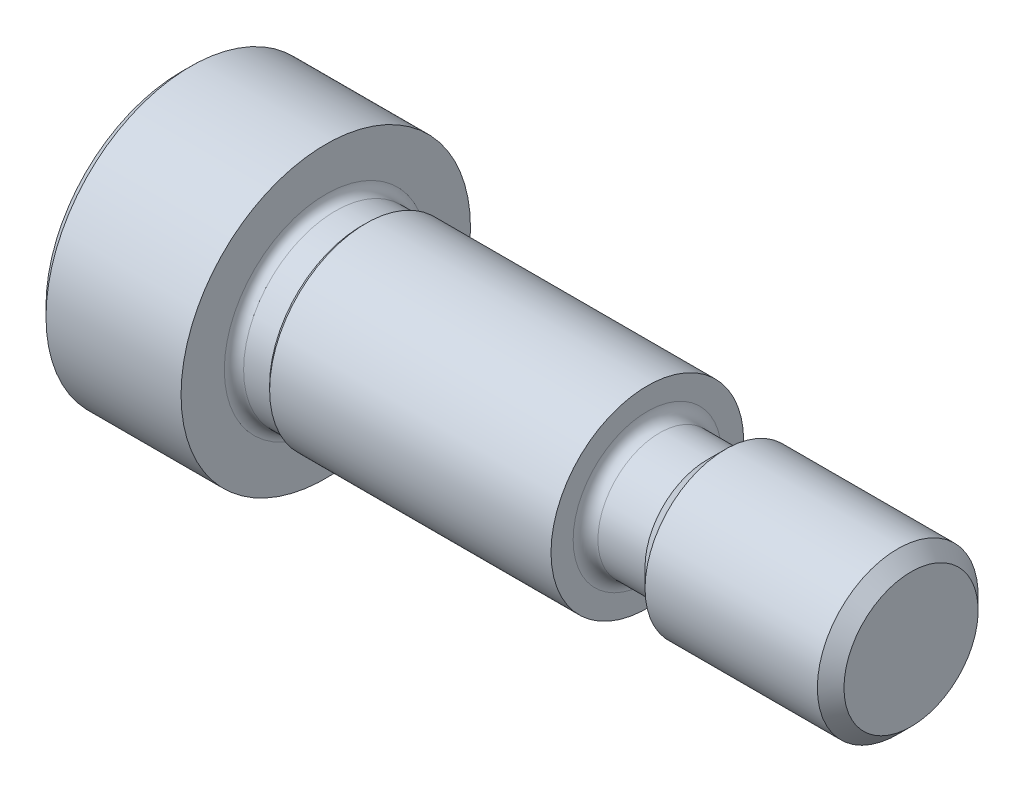
ISO-10303-21;
HEADER;
FILE_DESCRIPTION(('STEP AP214'),'2;1');
FILE_NAME('part.step','',(''),(''),'','','');
FILE_SCHEMA(('AUTOMOTIVE_DESIGN { 1 0 10303 214 1 1 1 1 }'));
ENDSEC;
DATA;
#1=APPLICATION_CONTEXT('core data for automotive mechanical design processes');
#2=APPLICATION_PROTOCOL_DEFINITION('international standard','automotive_design',2000,#1);
#3=PRODUCT_CONTEXT('',#1,'mechanical');
#4=PRODUCT('Part','Part','',(#3));
#5=PRODUCT_RELATED_PRODUCT_CATEGORY('part','',(#4));
#6=PRODUCT_DEFINITION_FORMATION('','',#4);
#7=PRODUCT_DEFINITION_CONTEXT('part definition',#1,'design');
#8=PRODUCT_DEFINITION('design','',#6,#7);
#9=PRODUCT_DEFINITION_SHAPE('','',#8);
#10=(LENGTH_UNIT() NAMED_UNIT(*) SI_UNIT(.MILLI.,.METRE.));
#11=(NAMED_UNIT(*) PLANE_ANGLE_UNIT() SI_UNIT($,.RADIAN.));
#12=(NAMED_UNIT(*) SI_UNIT($,.STERADIAN.) SOLID_ANGLE_UNIT());
#13=UNCERTAINTY_MEASURE_WITH_UNIT(LENGTH_MEASURE(1.E-05),#10,'distance_accuracy_value','');
#14=(GEOMETRIC_REPRESENTATION_CONTEXT(3) GLOBAL_UNCERTAINTY_ASSIGNED_CONTEXT((#13)) GLOBAL_UNIT_ASSIGNED_CONTEXT((#10,
#11,#12)) REPRESENTATION_CONTEXT('',''));
#15=CARTESIAN_POINT('',(0.,0.,0.));
#16=DIRECTION('',(0.,0.,1.));
#17=DIRECTION('',(1.,0.,0.));
#18=AXIS2_PLACEMENT_3D('',#15,#16,#17);
#19=CARTESIAN_POINT('',(0.,0.,0.));
#20=DIRECTION('',(-1.,0.,0.));
#21=DIRECTION('',(0.,0.,1.));
#22=AXIS2_PLACEMENT_3D('',#19,#20,#21);
#23=PLANE('',#22);
#24=CARTESIAN_POINT('',(0.,0.,0.));
#25=DIRECTION('',(-1.,0.,0.));
#26=DIRECTION('',(0.,0.,1.));
#27=AXIS2_PLACEMENT_3D('',#24,#25,#26);
#28=CIRCLE('',#27,8.4);
#29=CARTESIAN_POINT('',(0.,0.,8.4));
#30=VERTEX_POINT('',#29);
#31=EDGE_CURVE('E42',#30,#30,#28,.T.);
#32=ORIENTED_EDGE('',*,*,#31,.T.);
#33=EDGE_LOOP('',(#32));
#34=FACE_BOUND('',#33,.T.);
#35=DIRECTION('',(0.,-0.500000000000001,-0.866025403784438));
#36=VECTOR('',#35,1.);
#37=CARTESIAN_POINT('',(0.,-1.75947494535538,3.0475));
#38=LINE('',#37,#36);
#39=CARTESIAN_POINT('',(0.,-1.75947494535538,3.0475));
#40=VERTEX_POINT('',#39);
#41=CARTESIAN_POINT('',(0.,-3.51894989071077,0.));
#42=VERTEX_POINT('',#41);
#43=EDGE_CURVE('E49',#40,#42,#38,.T.);
#44=ORIENTED_EDGE('',*,*,#43,.T.);
#45=DIRECTION('',(0.,0.500000000000001,-0.866025403784438));
#46=VECTOR('',#45,1.);
#47=CARTESIAN_POINT('',(0.,-3.51894989071077,0.));
#48=LINE('',#47,#46);
#49=CARTESIAN_POINT('',(0.,-1.75947494535538,-3.0475));
#50=VERTEX_POINT('',#49);
#51=EDGE_CURVE('E304',#42,#50,#48,.T.);
#52=ORIENTED_EDGE('',*,*,#51,.T.);
#53=DIRECTION('',(0.,1.,0.));
#54=VECTOR('',#53,1.);
#55=CARTESIAN_POINT('',(0.,-1.75947494535538,-3.0475));
#56=LINE('',#55,#54);
#57=CARTESIAN_POINT('',(0.,1.75947494535538,-3.0475));
#58=VERTEX_POINT('',#57);
#59=EDGE_CURVE('E134',#50,#58,#56,.T.);
#60=ORIENTED_EDGE('',*,*,#59,.T.);
#61=DIRECTION('',(0.,0.500000000000001,0.866025403784438));
#62=VECTOR('',#61,1.);
#63=CARTESIAN_POINT('',(0.,1.75947494535538,-3.0475));
#64=LINE('',#63,#62);
#65=CARTESIAN_POINT('',(0.,3.51894989071077,0.));
#66=VERTEX_POINT('',#65);
#67=EDGE_CURVE('E307',#58,#66,#64,.T.);
#68=ORIENTED_EDGE('',*,*,#67,.T.);
#69=DIRECTION('',(0.,-0.500000000000001,0.866025403784438));
#70=VECTOR('',#69,1.);
#71=CARTESIAN_POINT('',(0.,3.51894989071077,0.));
#72=LINE('',#71,#70);
#73=CARTESIAN_POINT('',(0.,1.75947494535538,3.0475));
#74=VERTEX_POINT('',#73);
#75=EDGE_CURVE('E309',#66,#74,#72,.T.);
#76=ORIENTED_EDGE('',*,*,#75,.T.);
#77=DIRECTION('',(0.,-1.,0.));
#78=VECTOR('',#77,1.);
#79=CARTESIAN_POINT('',(0.,1.75947494535538,3.0475));
#80=LINE('',#79,#78);
#81=EDGE_CURVE('E311',#74,#40,#80,.T.);
#82=ORIENTED_EDGE('',*,*,#81,.T.);
#83=EDGE_LOOP('',(#44,#52,#60,#68,#76,#82));
#84=FACE_BOUND('',#83,.T.);
#85=ADVANCED_FACE('F34',(#34,#84),#23,.T.);
#86=CARTESIAN_POINT('',(-6.34999999999999,0.,0.));
#87=DIRECTION('',(-1.,0.,0.));
#88=DIRECTION('',(0.,0.,1.));
#89=AXIS2_PLACEMENT_3D('',#86,#87,#88);
#90=CYLINDRICAL_SURFACE('',#89,9.);
#91=CARTESIAN_POINT('',(0.600000000000002,0.,0.));
#92=DIRECTION('',(-1.,0.,0.));
#93=DIRECTION('',(0.,0.,1.));
#94=AXIS2_PLACEMENT_3D('',#91,#92,#93);
#95=CIRCLE('',#94,9.);
#96=CARTESIAN_POINT('',(0.600000000000002,0.,9.));
#97=VERTEX_POINT('',#96);
#98=EDGE_CURVE('E11',#97,#97,#95,.F.);
#99=ORIENTED_EDGE('',*,*,#98,.T.);
#100=EDGE_LOOP('',(#99));
#101=FACE_BOUND('',#100,.T.);
#102=CARTESIAN_POINT('',(9.,0.,0.));
#103=DIRECTION('',(-1.,0.,0.));
#104=DIRECTION('',(0.,0.,1.));
#105=AXIS2_PLACEMENT_3D('',#102,#103,#104);
#106=CIRCLE('',#105,9.);
#107=CARTESIAN_POINT('',(9.,0.,9.));
#108=VERTEX_POINT('',#107);
#109=EDGE_CURVE('E181',#108,#108,#106,.T.);
#110=ORIENTED_EDGE('',*,*,#109,.T.);
#111=EDGE_LOOP('',(#110));
#112=FACE_BOUND('',#111,.T.);
#113=ADVANCED_FACE('F200',(#101,#112),#90,.T.);
#114=CARTESIAN_POINT('',(9.,9.,0.));
#115=DIRECTION('',(1.,0.,0.));
#116=DIRECTION('',(0.,0.,-1.));
#117=AXIS2_PLACEMENT_3D('',#114,#115,#116);
#118=PLANE('',#117);
#119=CARTESIAN_POINT('',(9.,0.,0.));
#120=DIRECTION('',(-1.,0.,0.));
#121=DIRECTION('',(0.,0.,1.));
#122=AXIS2_PLACEMENT_3D('',#119,#120,#121);
#123=CIRCLE('',#122,6.31);
#124=CARTESIAN_POINT('',(9.,0.,6.31));
#125=VERTEX_POINT('',#124);
#126=EDGE_CURVE('E178',#125,#125,#123,.T.);
#127=ORIENTED_EDGE('',*,*,#126,.T.);
#128=EDGE_LOOP('',(#127));
#129=FACE_BOUND('',#128,.T.);
#130=ORIENTED_EDGE('',*,*,#109,.F.);
#131=EDGE_LOOP('',(#130));
#132=FACE_BOUND('',#131,.T.);
#133=ADVANCED_FACE('F204',(#129,#132),#118,.T.);
#134=CARTESIAN_POINT('',(9.6,0.,0.));
#135=DIRECTION('',(-1.,0.,0.));
#136=DIRECTION('',(0.,0.,1.));
#137=AXIS2_PLACEMENT_3D('',#134,#135,#136);
#138=TOROIDAL_SURFACE('',#137,6.31,0.599999999999999);
#139=ORIENTED_EDGE('',*,*,#126,.F.);
#140=EDGE_LOOP('',(#139));
#141=FACE_BOUND('',#140,.T.);
#142=CARTESIAN_POINT('',(9.6,0.,0.));
#143=DIRECTION('',(-1.,0.,0.));
#144=DIRECTION('',(0.,0.,1.));
#145=AXIS2_PLACEMENT_3D('',#142,#143,#144);
#146=CIRCLE('',#145,5.71);
#147=CARTESIAN_POINT('',(9.6,0.,5.71));
#148=VERTEX_POINT('',#147);
#149=EDGE_CURVE('E175',#148,#148,#146,.T.);
#150=ORIENTED_EDGE('',*,*,#149,.T.);
#151=EDGE_LOOP('',(#150));
#152=FACE_BOUND('',#151,.T.);
#153=ADVANCED_FACE('F210',(#141,#152),#138,.F.);
#154=CARTESIAN_POINT('',(-6.34999999999999,0.,0.));
#155=DIRECTION('',(-1.,0.,0.));
#156=DIRECTION('',(0.,0.,1.));
#157=AXIS2_PLACEMENT_3D('',#154,#155,#156);
#158=CYLINDRICAL_SURFACE('',#157,5.71);
#159=CARTESIAN_POINT('',(11.218,0.,0.));
#160=DIRECTION('',(-1.,0.,0.));
#161=DIRECTION('',(0.,0.,1.));
#162=AXIS2_PLACEMENT_3D('',#159,#160,#161);
#163=CIRCLE('',#162,5.71);
#164=CARTESIAN_POINT('',(11.218,0.,5.71));
#165=VERTEX_POINT('',#164);
#166=EDGE_CURVE('E172',#165,#165,#163,.T.);
#167=ORIENTED_EDGE('',*,*,#166,.T.);
#168=EDGE_LOOP('',(#167));
#169=FACE_BOUND('',#168,.T.);
#170=ORIENTED_EDGE('',*,*,#149,.F.);
#171=EDGE_LOOP('',(#170));
#172=FACE_BOUND('',#171,.T.);
#173=ADVANCED_FACE('F214',(#169,#172),#158,.T.);
#174=CARTESIAN_POINT('',(11.218,0.,0.));
#175=DIRECTION('',(1.,0.,0.));
#176=DIRECTION('',(0.,0.,-1.));
#177=AXIS2_PLACEMENT_3D('',#174,#175,#176);
#178=CONICAL_SURFACE('',#177,5.71,0.785398163397448);
#179=CARTESIAN_POINT('',(11.5,0.,0.));
#180=DIRECTION('',(-1.,0.,0.));
#181=DIRECTION('',(0.,0.,1.));
#182=AXIS2_PLACEMENT_3D('',#179,#180,#181);
#183=CIRCLE('',#182,5.992);
#184=CARTESIAN_POINT('',(11.5,0.,5.992));
#185=VERTEX_POINT('',#184);
#186=EDGE_CURVE('E169',#185,#185,#183,.T.);
#187=ORIENTED_EDGE('',*,*,#186,.T.);
#188=EDGE_LOOP('',(#187));
#189=FACE_BOUND('',#188,.T.);
#190=ORIENTED_EDGE('',*,*,#166,.F.);
#191=EDGE_LOOP('',(#190));
#192=FACE_BOUND('',#191,.T.);
#193=ADVANCED_FACE('F218',(#189,#192),#178,.T.);
#194=CARTESIAN_POINT('',(-6.34999999999999,0.,0.));
#195=DIRECTION('',(-1.,0.,0.));
#196=DIRECTION('',(0.,0.,1.));
#197=AXIS2_PLACEMENT_3D('',#194,#195,#196);
#198=CYLINDRICAL_SURFACE('',#197,5.992);
#199=CARTESIAN_POINT('',(29.,0.,0.));
#200=DIRECTION('',(-1.,0.,0.));
#201=DIRECTION('',(0.,0.,1.));
#202=AXIS2_PLACEMENT_3D('',#199,#200,#201);
#203=CIRCLE('',#202,5.992);
#204=CARTESIAN_POINT('',(29.,0.,5.992));
#205=VERTEX_POINT('',#204);
#206=EDGE_CURVE('E166',#205,#205,#203,.T.);
#207=ORIENTED_EDGE('',*,*,#206,.T.);
#208=EDGE_LOOP('',(#207));
#209=FACE_BOUND('',#208,.T.);
#210=ORIENTED_EDGE('',*,*,#186,.F.);
#211=EDGE_LOOP('',(#210));
#212=FACE_BOUND('',#211,.T.);
#213=ADVANCED_FACE('F222',(#209,#212),#198,.T.);
#214=CARTESIAN_POINT('',(29.,5.992,0.));
#215=DIRECTION('',(1.,0.,0.));
#216=DIRECTION('',(0.,0.,-1.));
#217=AXIS2_PLACEMENT_3D('',#214,#215,#216);
#218=PLANE('',#217);
#219=CARTESIAN_POINT('',(29.,0.,0.));
#220=DIRECTION('',(-1.,0.,0.));
#221=DIRECTION('',(0.,0.,1.));
#222=AXIS2_PLACEMENT_3D('',#219,#220,#221);
#223=CIRCLE('',#222,4.615);
#224=CARTESIAN_POINT('',(29.,0.,4.615));
#225=VERTEX_POINT('',#224);
#226=EDGE_CURVE('E163',#225,#225,#223,.T.);
#227=ORIENTED_EDGE('',*,*,#226,.T.);
#228=EDGE_LOOP('',(#227));
#229=FACE_BOUND('',#228,.T.);
#230=ORIENTED_EDGE('',*,*,#206,.F.);
#231=EDGE_LOOP('',(#230));
#232=FACE_BOUND('',#231,.T.);
#233=ADVANCED_FACE('F226',(#229,#232),#218,.T.);
#234=CARTESIAN_POINT('',(29.77,0.,0.));
#235=DIRECTION('',(-1.,0.,0.));
#236=DIRECTION('',(0.,0.,1.));
#237=AXIS2_PLACEMENT_3D('',#234,#235,#236);
#238=TOROIDAL_SURFACE('',#237,4.615,0.769999999999998);
#239=CARTESIAN_POINT('',(29.77,0.,0.));
#240=DIRECTION('',(-1.,0.,0.));
#241=DIRECTION('',(0.,0.,1.));
#242=AXIS2_PLACEMENT_3D('',#239,#240,#241);
#243=CIRCLE('',#242,3.845);
#244=CARTESIAN_POINT('',(29.77,0.,3.845));
#245=VERTEX_POINT('',#244);
#246=EDGE_CURVE('E160',#245,#245,#243,.T.);
#247=ORIENTED_EDGE('',*,*,#246,.T.);
#248=EDGE_LOOP('',(#247));
#249=FACE_BOUND('',#248,.T.);
#250=ORIENTED_EDGE('',*,*,#226,.F.);
#251=EDGE_LOOP('',(#250));
#252=FACE_BOUND('',#251,.T.);
#253=ADVANCED_FACE('F230',(#249,#252),#238,.F.);
#254=CARTESIAN_POINT('',(-6.34999999999999,0.,0.));
#255=DIRECTION('',(-1.,0.,0.));
#256=DIRECTION('',(0.,0.,1.));
#257=AXIS2_PLACEMENT_3D('',#254,#255,#256);
#258=CYLINDRICAL_SURFACE('',#257,3.845);
#259=CARTESIAN_POINT('',(32.7,0.,0.));
#260=DIRECTION('',(-1.,0.,0.));
#261=DIRECTION('',(0.,0.,1.));
#262=AXIS2_PLACEMENT_3D('',#259,#260,#261);
#263=CIRCLE('',#262,3.845);
#264=CARTESIAN_POINT('',(32.7,0.,3.845));
#265=VERTEX_POINT('',#264);
#266=EDGE_CURVE('E157',#265,#265,#263,.T.);
#267=ORIENTED_EDGE('',*,*,#266,.T.);
#268=EDGE_LOOP('',(#267));
#269=FACE_BOUND('',#268,.T.);
#270=ORIENTED_EDGE('',*,*,#246,.F.);
#271=EDGE_LOOP('',(#270));
#272=FACE_BOUND('',#271,.T.);
#273=ADVANCED_FACE('F234',(#269,#272),#258,.T.);
#274=CARTESIAN_POINT('',(32.7,0.,0.));
#275=DIRECTION('',(1.,0.,0.));
#276=DIRECTION('',(0.,0.,-1.));
#277=AXIS2_PLACEMENT_3D('',#274,#275,#276);
#278=CONICAL_SURFACE('',#277,3.845,0.785398163397447);
#279=CARTESIAN_POINT('',(33.855,0.,0.));
#280=DIRECTION('',(-1.,0.,0.));
#281=DIRECTION('',(0.,0.,1.));
#282=AXIS2_PLACEMENT_3D('',#279,#280,#281);
#283=CIRCLE('',#282,5.);
#284=CARTESIAN_POINT('',(33.855,0.,5.));
#285=VERTEX_POINT('',#284);
#286=EDGE_CURVE('E154',#285,#285,#283,.T.);
#287=ORIENTED_EDGE('',*,*,#286,.T.);
#288=EDGE_LOOP('',(#287));
#289=FACE_BOUND('',#288,.T.);
#290=ORIENTED_EDGE('',*,*,#266,.F.);
#291=EDGE_LOOP('',(#290));
#292=FACE_BOUND('',#291,.T.);
#293=ADVANCED_FACE('F238',(#289,#292),#278,.T.);
#294=CARTESIAN_POINT('',(-6.34999999999999,0.,0.));
#295=DIRECTION('',(-1.,0.,0.));
#296=DIRECTION('',(0.,0.,1.));
#297=AXIS2_PLACEMENT_3D('',#294,#295,#296);
#298=CYLINDRICAL_SURFACE('',#297,5.);
#299=CARTESIAN_POINT('',(44.572,0.,0.));
#300=DIRECTION('',(-1.,0.,0.));
#301=DIRECTION('',(0.,0.,1.));
#302=AXIS2_PLACEMENT_3D('',#299,#300,#301);
#303=CIRCLE('',#302,5.);
#304=CARTESIAN_POINT('',(44.572,0.,5.));
#305=VERTEX_POINT('',#304);
#306=EDGE_CURVE('E151',#305,#305,#303,.T.);
#307=ORIENTED_EDGE('',*,*,#306,.T.);
#308=EDGE_LOOP('',(#307));
#309=FACE_BOUND('',#308,.T.);
#310=ORIENTED_EDGE('',*,*,#286,.F.);
#311=EDGE_LOOP('',(#310));
#312=FACE_BOUND('',#311,.T.);
#313=ADVANCED_FACE('F242',(#309,#312),#298,.T.);
#314=CARTESIAN_POINT('',(44.572,0.,0.));
#315=DIRECTION('',(-1.,0.,0.));
#316=DIRECTION('',(0.,0.,1.));
#317=AXIS2_PLACEMENT_3D('',#314,#315,#316);
#318=CONICAL_SURFACE('',#317,5.,0.785398163397432);
#319=CARTESIAN_POINT('',(45.4,0.,0.));
#320=DIRECTION('',(-1.,0.,0.));
#321=DIRECTION('',(0.,0.,1.));
#322=AXIS2_PLACEMENT_3D('',#319,#320,#321);
#323=CIRCLE('',#322,4.17200000000001);
#324=CARTESIAN_POINT('',(45.4,0.,4.17200000000001));
#325=VERTEX_POINT('',#324);
#326=EDGE_CURVE('E147',#325,#325,#323,.T.);
#327=ORIENTED_EDGE('',*,*,#326,.T.);
#328=EDGE_LOOP('',(#327));
#329=FACE_BOUND('',#328,.T.);
#330=ORIENTED_EDGE('',*,*,#306,.F.);
#331=EDGE_LOOP('',(#330));
#332=FACE_BOUND('',#331,.T.);
#333=ADVANCED_FACE('F195',(#329,#332),#318,.T.);
#334=CARTESIAN_POINT('',(45.4,4.17200000000001,0.));
#335=DIRECTION('',(1.,0.,0.));
#336=DIRECTION('',(0.,0.,-1.));
#337=AXIS2_PLACEMENT_3D('',#334,#335,#336);
#338=PLANE('',#337);
#339=ORIENTED_EDGE('',*,*,#326,.F.);
#340=EDGE_LOOP('',(#339));
#341=FACE_BOUND('',#340,.T.);
#342=ADVANCED_FACE('F188',(#341),#338,.T.);
#343=CARTESIAN_POINT('',(0.,0.,0.));
#344=DIRECTION('',(1.,0.,0.));
#345=DIRECTION('',(0.,0.,-1.));
#346=AXIS2_PLACEMENT_3D('',#343,#344,#345);
#347=CONICAL_SURFACE('',#346,8.4,0.785398163397447);
#348=ORIENTED_EDGE('',*,*,#98,.F.);
#349=EDGE_LOOP('',(#348));
#350=FACE_BOUND('',#349,.T.);
#351=ORIENTED_EDGE('',*,*,#31,.F.);
#352=EDGE_LOOP('',(#351));
#353=FACE_BOUND('',#352,.T.);
#354=ADVANCED_FACE('F36',(#350,#353),#347,.T.);
#355=CARTESIAN_POINT('',(4.9,-3.51894989071077,0.));
#356=DIRECTION('',(0.,0.866025403784438,0.500000000000001));
#357=DIRECTION('',(0.,-0.500000000000001,0.866025403784438));
#358=AXIS2_PLACEMENT_3D('',#355,#356,#357);
#359=PLANE('',#358);
#360=DIRECTION('',(0.,0.500000000000001,-0.866025403784438));
#361=VECTOR('',#360,1.);
#362=CARTESIAN_POINT('',(4.9,-3.51894989071077,0.));
#363=LINE('',#362,#361);
#364=CARTESIAN_POINT('',(4.9,-3.51894989071077,0.));
#365=VERTEX_POINT('',#364);
#366=CARTESIAN_POINT('',(4.9,-2.63921241803307,-1.52375));
#367=VERTEX_POINT('',#366);
#368=EDGE_CURVE('E117',#365,#367,#363,.T.);
#369=ORIENTED_EDGE('',*,*,#368,.T.);
#370=CARTESIAN_POINT('',(4.9,-1.75947494535538,-3.0475));
#371=VERTEX_POINT('',#370);
#372=EDGE_CURVE('E110',#367,#371,#363,.T.);
#373=ORIENTED_EDGE('',*,*,#372,.T.);
#374=DIRECTION('',(-1.,0.,0.));
#375=VECTOR('',#374,1.);
#376=CARTESIAN_POINT('',(4.9,-1.75947494535538,-3.0475));
#377=LINE('',#376,#375);
#378=EDGE_CURVE('E114',#371,#50,#377,.T.);
#379=ORIENTED_EDGE('',*,*,#378,.T.);
#380=ORIENTED_EDGE('',*,*,#51,.F.);
#381=DIRECTION('',(-1.,0.,0.));
#382=VECTOR('',#381,1.);
#383=CARTESIAN_POINT('',(4.9,-3.51894989071077,0.));
#384=LINE('',#383,#382);
#385=EDGE_CURVE('E303',#365,#42,#384,.T.);
#386=ORIENTED_EDGE('',*,*,#385,.F.);
#387=EDGE_LOOP('',(#369,#373,#379,#380,#386));
#388=FACE_BOUND('',#387,.T.);
#389=ADVANCED_FACE('F112',(#388),#359,.T.);
#390=CARTESIAN_POINT('',(4.9,-1.75947494535538,-3.0475));
#391=DIRECTION('',(0.,0.,1.));
#392=DIRECTION('',(1.,0.,0.));
#393=AXIS2_PLACEMENT_3D('',#390,#391,#392);
#394=PLANE('',#393);
#395=DIRECTION('',(0.,1.,0.));
#396=VECTOR('',#395,1.);
#397=CARTESIAN_POINT('',(4.9,-1.75947494535538,-3.0475));
#398=LINE('',#397,#396);
#399=CARTESIAN_POINT('',(4.9,0.,-3.0475));
#400=VERTEX_POINT('',#399);
#401=EDGE_CURVE('E122',#371,#400,#398,.T.);
#402=ORIENTED_EDGE('',*,*,#401,.T.);
#403=CARTESIAN_POINT('',(4.9,1.75947494535538,-3.0475));
#404=VERTEX_POINT('',#403);
#405=EDGE_CURVE('E129',#400,#404,#398,.T.);
#406=ORIENTED_EDGE('',*,*,#405,.T.);
#407=DIRECTION('',(-1.,0.,0.));
#408=VECTOR('',#407,1.);
#409=CARTESIAN_POINT('',(4.9,1.75947494535538,-3.0475));
#410=LINE('',#409,#408);
#411=EDGE_CURVE('E136',#404,#58,#410,.T.);
#412=ORIENTED_EDGE('',*,*,#411,.T.);
#413=ORIENTED_EDGE('',*,*,#59,.F.);
#414=ORIENTED_EDGE('',*,*,#378,.F.);
#415=EDGE_LOOP('',(#402,#406,#412,#413,#414));
#416=FACE_BOUND('',#415,.T.);
#417=ADVANCED_FACE('F132',(#416),#394,.T.);
#418=CARTESIAN_POINT('',(4.9,1.75947494535538,-3.0475));
#419=DIRECTION('',(0.,-0.866025403784438,0.500000000000001));
#420=DIRECTION('',(0.,-0.500000000000001,-0.866025403784438));
#421=AXIS2_PLACEMENT_3D('',#418,#419,#420);
#422=PLANE('',#421);
#423=DIRECTION('',(0.,0.500000000000001,0.866025403784438));
#424=VECTOR('',#423,1.);
#425=CARTESIAN_POINT('',(4.9,1.75947494535538,-3.0475));
#426=LINE('',#425,#424);
#427=CARTESIAN_POINT('',(4.9,2.63921241803308,-1.52375));
#428=VERTEX_POINT('',#427);
#429=EDGE_CURVE('E331',#404,#428,#426,.T.);
#430=ORIENTED_EDGE('',*,*,#429,.T.);
#431=CARTESIAN_POINT('',(4.9,3.51894989071077,0.));
#432=VERTEX_POINT('',#431);
#433=EDGE_CURVE('E128',#428,#432,#426,.T.);
#434=ORIENTED_EDGE('',*,*,#433,.T.);
#435=DIRECTION('',(-1.,0.,0.));
#436=VECTOR('',#435,1.);
#437=CARTESIAN_POINT('',(4.9,3.51894989071077,0.));
#438=LINE('',#437,#436);
#439=EDGE_CURVE('E142',#432,#66,#438,.T.);
#440=ORIENTED_EDGE('',*,*,#439,.T.);
#441=ORIENTED_EDGE('',*,*,#67,.F.);
#442=ORIENTED_EDGE('',*,*,#411,.F.);
#443=EDGE_LOOP('',(#430,#434,#440,#441,#442));
#444=FACE_BOUND('',#443,.T.);
#445=ADVANCED_FACE('F257',(#444),#422,.T.);
#446=CARTESIAN_POINT('',(4.9,3.51894989071077,0.));
#447=DIRECTION('',(0.,-0.866025403784438,-0.500000000000001));
#448=DIRECTION('',(0.,0.500000000000001,-0.866025403784438));
#449=AXIS2_PLACEMENT_3D('',#446,#447,#448);
#450=PLANE('',#449);
#451=DIRECTION('',(0.,-0.500000000000001,0.866025403784438));
#452=VECTOR('',#451,1.);
#453=CARTESIAN_POINT('',(4.9,3.51894989071077,0.));
#454=LINE('',#453,#452);
#455=CARTESIAN_POINT('',(4.9,2.63921241803308,1.52375));
#456=VERTEX_POINT('',#455);
#457=EDGE_CURVE('E298',#432,#456,#454,.T.);
#458=ORIENTED_EDGE('',*,*,#457,.T.);
#459=CARTESIAN_POINT('',(4.9,1.75947494535538,3.0475));
#460=VERTEX_POINT('',#459);
#461=EDGE_CURVE('E291',#456,#460,#454,.T.);
#462=ORIENTED_EDGE('',*,*,#461,.T.);
#463=DIRECTION('',(-1.,0.,0.));
#464=VECTOR('',#463,1.);
#465=CARTESIAN_POINT('',(4.9,1.75947494535538,3.0475));
#466=LINE('',#465,#464);
#467=EDGE_CURVE('E319',#460,#74,#466,.T.);
#468=ORIENTED_EDGE('',*,*,#467,.T.);
#469=ORIENTED_EDGE('',*,*,#75,.F.);
#470=ORIENTED_EDGE('',*,*,#439,.F.);
#471=EDGE_LOOP('',(#458,#462,#468,#469,#470));
#472=FACE_BOUND('',#471,.T.);
#473=ADVANCED_FACE('F260',(#472),#450,.T.);
#474=CARTESIAN_POINT('',(4.9,1.75947494535538,3.0475));
#475=DIRECTION('',(0.,0.,-1.));
#476=DIRECTION('',(-1.,0.,0.));
#477=AXIS2_PLACEMENT_3D('',#474,#475,#476);
#478=PLANE('',#477);
#479=DIRECTION('',(0.,-1.,0.));
#480=VECTOR('',#479,1.);
#481=CARTESIAN_POINT('',(4.9,1.75947494535538,3.0475));
#482=LINE('',#481,#480);
#483=CARTESIAN_POINT('',(4.9,0.,3.0475));
#484=VERTEX_POINT('',#483);
#485=EDGE_CURVE('E57',#460,#484,#482,.T.);
#486=ORIENTED_EDGE('',*,*,#485,.T.);
#487=CARTESIAN_POINT('',(4.9,-1.75947494535538,3.0475));
#488=VERTEX_POINT('',#487);
#489=EDGE_CURVE('E294',#484,#488,#482,.T.);
#490=ORIENTED_EDGE('',*,*,#489,.T.);
#491=DIRECTION('',(-1.,0.,0.));
#492=VECTOR('',#491,1.);
#493=CARTESIAN_POINT('',(4.9,-1.75947494535538,3.0475));
#494=LINE('',#493,#492);
#495=EDGE_CURVE('E316',#488,#40,#494,.T.);
#496=ORIENTED_EDGE('',*,*,#495,.T.);
#497=ORIENTED_EDGE('',*,*,#81,.F.);
#498=ORIENTED_EDGE('',*,*,#467,.F.);
#499=EDGE_LOOP('',(#486,#490,#496,#497,#498));
#500=FACE_BOUND('',#499,.T.);
#501=ADVANCED_FACE('F264',(#500),#478,.T.);
#502=CARTESIAN_POINT('',(4.9,-1.75947494535538,3.0475));
#503=DIRECTION('',(0.,0.866025403784438,-0.500000000000001));
#504=DIRECTION('',(0.,0.500000000000001,0.866025403784438));
#505=AXIS2_PLACEMENT_3D('',#502,#503,#504);
#506=PLANE('',#505);
#507=DIRECTION('',(0.,-0.500000000000001,-0.866025403784438));
#508=VECTOR('',#507,1.);
#509=CARTESIAN_POINT('',(4.9,-1.75947494535538,3.0475));
#510=LINE('',#509,#508);
#511=CARTESIAN_POINT('',(4.9,-2.63921241803307,1.52375));
#512=VERTEX_POINT('',#511);
#513=EDGE_CURVE('E296',#488,#512,#510,.T.);
#514=ORIENTED_EDGE('',*,*,#513,.T.);
#515=EDGE_CURVE('E293',#512,#365,#510,.T.);
#516=ORIENTED_EDGE('',*,*,#515,.T.);
#517=ORIENTED_EDGE('',*,*,#385,.T.);
#518=ORIENTED_EDGE('',*,*,#43,.F.);
#519=ORIENTED_EDGE('',*,*,#495,.F.);
#520=EDGE_LOOP('',(#514,#516,#517,#518,#519));
#521=FACE_BOUND('',#520,.T.);
#522=ADVANCED_FACE('F268',(#521),#506,.T.);
#523=CARTESIAN_POINT('',(4.9,-3.51894989071077,0.));
#524=DIRECTION('',(-1.,0.,0.));
#525=DIRECTION('',(0.,0.,1.));
#526=AXIS2_PLACEMENT_3D('',#523,#524,#525);
#527=PLANE('',#526);
#528=ORIENTED_EDGE('',*,*,#485,.F.);
#529=ORIENTED_EDGE('',*,*,#461,.F.);
#530=CARTESIAN_POINT('',(4.9,0.,0.));
#531=DIRECTION('',(-1.,0.,0.));
#532=DIRECTION('',(0.,0.,1.));
#533=AXIS2_PLACEMENT_3D('',#530,#531,#532);
#534=CIRCLE('',#533,3.0475);
#535=EDGE_CURVE('E141',#484,#456,#534,.T.);
#536=ORIENTED_EDGE('',*,*,#535,.F.);
#537=EDGE_LOOP('',(#528,#529,#536));
#538=FACE_BOUND('',#537,.T.);
#539=ADVANCED_FACE('F271',(#538),#527,.T.);
#540=ORIENTED_EDGE('',*,*,#457,.F.);
#541=ORIENTED_EDGE('',*,*,#433,.F.);
#542=EDGE_CURVE('E148',#456,#428,#534,.T.);
#543=ORIENTED_EDGE('',*,*,#542,.F.);
#544=EDGE_LOOP('',(#540,#541,#543));
#545=FACE_BOUND('',#544,.T.);
#546=ADVANCED_FACE('F282',(#545),#527,.T.);
#547=ORIENTED_EDGE('',*,*,#429,.F.);
#548=ORIENTED_EDGE('',*,*,#405,.F.);
#549=EDGE_CURVE('E334',#428,#400,#534,.T.);
#550=ORIENTED_EDGE('',*,*,#549,.F.);
#551=EDGE_LOOP('',(#547,#548,#550));
#552=FACE_BOUND('',#551,.T.);
#553=ADVANCED_FACE('F287',(#552),#527,.T.);
#554=ORIENTED_EDGE('',*,*,#401,.F.);
#555=ORIENTED_EDGE('',*,*,#372,.F.);
#556=EDGE_CURVE('E124',#400,#367,#534,.T.);
#557=ORIENTED_EDGE('',*,*,#556,.F.);
#558=EDGE_LOOP('',(#554,#555,#557));
#559=FACE_BOUND('',#558,.T.);
#560=ADVANCED_FACE('F123',(#559),#527,.T.);
#561=ORIENTED_EDGE('',*,*,#368,.F.);
#562=ORIENTED_EDGE('',*,*,#515,.F.);
#563=EDGE_CURVE('E139',#367,#512,#534,.T.);
#564=ORIENTED_EDGE('',*,*,#563,.F.);
#565=EDGE_LOOP('',(#561,#562,#564));
#566=FACE_BOUND('',#565,.T.);
#567=ADVANCED_FACE('F274',(#566),#527,.T.);
#568=ORIENTED_EDGE('',*,*,#513,.F.);
#569=ORIENTED_EDGE('',*,*,#489,.F.);
#570=EDGE_CURVE('E135',#512,#484,#534,.T.);
#571=ORIENTED_EDGE('',*,*,#570,.F.);
#572=EDGE_LOOP('',(#568,#569,#571));
#573=FACE_BOUND('',#572,.T.);
#574=ADVANCED_FACE('F252',(#573),#527,.T.);
#575=CARTESIAN_POINT('',(6.6594749453554,0.,0.));
#576=DIRECTION('',(-1.,0.,0.));
#577=DIRECTION('',(0.,0.,1.));
#578=AXIS2_PLACEMENT_3D('',#575,#576,#577);
#579=CONICAL_SURFACE('',#578,0.,1.04719755119659);
#580=ORIENTED_EDGE('',*,*,#535,.T.);
#581=ORIENTED_EDGE('',*,*,#542,.T.);
#582=ORIENTED_EDGE('',*,*,#549,.T.);
#583=ORIENTED_EDGE('',*,*,#556,.T.);
#584=ORIENTED_EDGE('',*,*,#563,.T.);
#585=ORIENTED_EDGE('',*,*,#570,.T.);
#586=EDGE_LOOP('',(#580,#581,#582,#583,#584,#585));
#587=FACE_BOUND('',#586,.T.);
#588=CARTESIAN_POINT('',(6.6594749453554,0.,0.));
#589=VERTEX_POINT('',#588);
#590=VERTEX_LOOP('',#589);
#591=FACE_BOUND('',#590,.T.);
#592=ADVANCED_FACE('F250',(#587,#591),#579,.F.);
#593=CLOSED_SHELL('',(#85,#113,#133,#153,#173,#193,#213,#233,#253,#273,#293,#313,#333,#342,#354,
#389,#417,#445,#473,#501,#522,#539,#546,#553,#560,#567,#574,#592));
#594=MANIFOLD_SOLID_BREP('B2',#593);
#595=ADVANCED_BREP_SHAPE_REPRESENTATION('',(#18,#594),#14);
#596=SHAPE_DEFINITION_REPRESENTATION(#9,#595);
ENDSEC;
END-ISO-10303-21;
